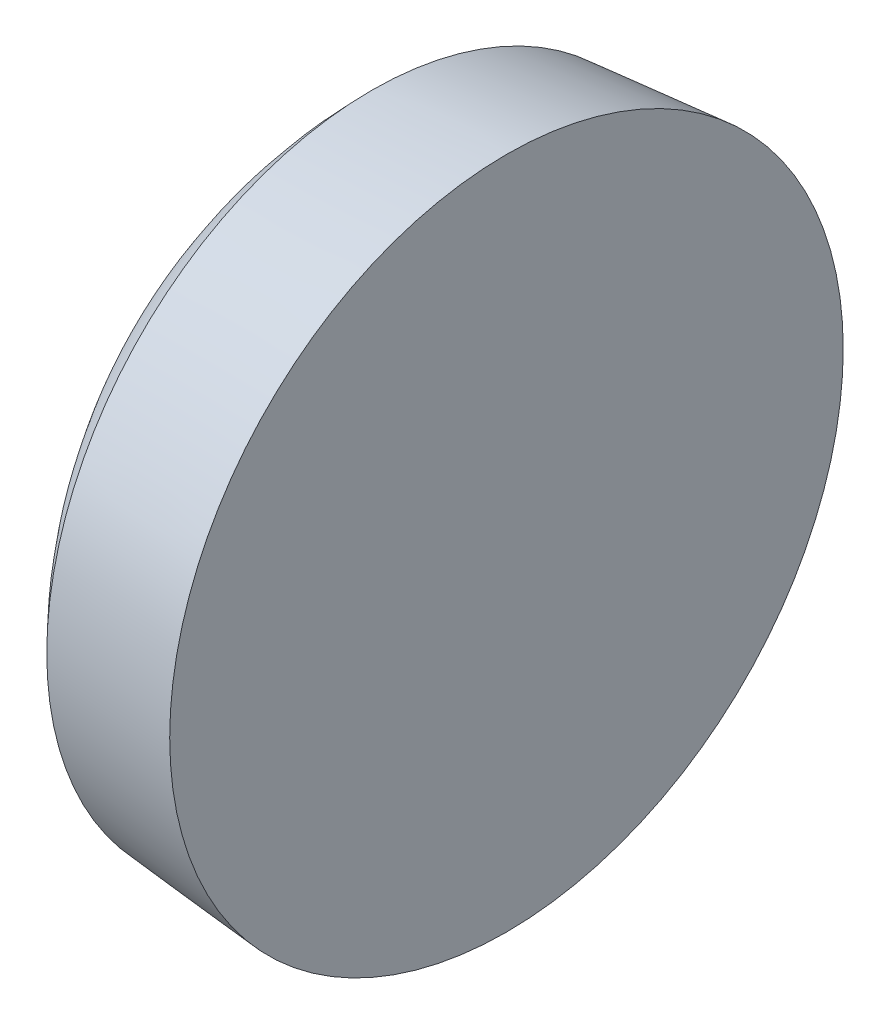
ISO-10303-21;
HEADER;
FILE_DESCRIPTION(('STEP AP214'),'2;1');
FILE_NAME('part.step','',(''),(''),'','','');
FILE_SCHEMA(('AUTOMOTIVE_DESIGN { 1 0 10303 214 1 1 1 1 }'));
ENDSEC;
DATA;
#1=APPLICATION_CONTEXT('core data for automotive mechanical design processes');
#2=APPLICATION_PROTOCOL_DEFINITION('international standard','automotive_design',2000,#1);
#3=PRODUCT_CONTEXT('',#1,'mechanical');
#4=PRODUCT('Part','Part','',(#3));
#5=PRODUCT_RELATED_PRODUCT_CATEGORY('part','',(#4));
#6=PRODUCT_DEFINITION_FORMATION('','',#4);
#7=PRODUCT_DEFINITION_CONTEXT('part definition',#1,'design');
#8=PRODUCT_DEFINITION('design','',#6,#7);
#9=PRODUCT_DEFINITION_SHAPE('','',#8);
#10=(LENGTH_UNIT() NAMED_UNIT(*) SI_UNIT(.MILLI.,.METRE.));
#11=(NAMED_UNIT(*) PLANE_ANGLE_UNIT() SI_UNIT($,.RADIAN.));
#12=(NAMED_UNIT(*) SI_UNIT($,.STERADIAN.) SOLID_ANGLE_UNIT());
#13=UNCERTAINTY_MEASURE_WITH_UNIT(LENGTH_MEASURE(1.E-05),#10,'distance_accuracy_value','');
#14=(GEOMETRIC_REPRESENTATION_CONTEXT(3) GLOBAL_UNCERTAINTY_ASSIGNED_CONTEXT((#13)) GLOBAL_UNIT_ASSIGNED_CONTEXT((#10,
#11,#12)) REPRESENTATION_CONTEXT('',''));
#15=CARTESIAN_POINT('',(0.,0.,0.));
#16=DIRECTION('',(0.,0.,1.));
#17=DIRECTION('',(1.,0.,0.));
#18=AXIS2_PLACEMENT_3D('',#15,#16,#17);
#19=CARTESIAN_POINT('',(71.8666666666667,-6.9,10.));
#20=DIRECTION('',(-1.,0.,0.));
#21=DIRECTION('',(0.,0.,1.));
#22=AXIS2_PLACEMENT_3D('',#19,#20,#21);
#23=PLANE('',#22);
#24=DIRECTION('',(0.,0.,-1.));
#25=VECTOR('',#24,1.);
#26=CARTESIAN_POINT('',(71.8666666666667,-5.95,10.));
#27=LINE('',#26,#25);
#28=CARTESIAN_POINT('',(71.8666666666667,-5.95,9.82));
#29=VERTEX_POINT('',#28);
#30=CARTESIAN_POINT('',(71.8666666666667,-5.95,10.18));
#31=VERTEX_POINT('',#30);
#32=EDGE_CURVE('E293',#29,#31,#27,.F.);
#33=ORIENTED_EDGE('',*,*,#32,.F.);
#34=DIRECTION('',(0.,1.,0.));
#35=VECTOR('',#34,1.);
#36=CARTESIAN_POINT('',(71.8666666666667,-6.9,9.82));
#37=LINE('',#36,#35);
#38=CARTESIAN_POINT('',(71.8666666666667,-6.72,9.82));
#39=VERTEX_POINT('',#38);
#40=EDGE_CURVE('E298',#39,#29,#37,.T.);
#41=ORIENTED_EDGE('',*,*,#40,.F.);
#42=DIRECTION('',(0.,0.,-1.));
#43=VECTOR('',#42,1.);
#44=CARTESIAN_POINT('',(71.8666666666667,-6.72,10.));
#45=LINE('',#44,#43);
#46=CARTESIAN_POINT('',(71.8666666666667,-6.72,9.05));
#47=VERTEX_POINT('',#46);
#48=EDGE_CURVE('E303',#47,#39,#45,.F.);
#49=ORIENTED_EDGE('',*,*,#48,.F.);
#50=DIRECTION('',(0.,1.,0.));
#51=VECTOR('',#50,1.);
#52=CARTESIAN_POINT('',(71.8666666666667,-6.9,9.05));
#53=LINE('',#52,#51);
#54=CARTESIAN_POINT('',(71.8666666666667,-7.08,9.05));
#55=VERTEX_POINT('',#54);
#56=EDGE_CURVE('E308',#55,#47,#53,.T.);
#57=ORIENTED_EDGE('',*,*,#56,.F.);
#58=DIRECTION('',(0.,0.,1.));
#59=VECTOR('',#58,1.);
#60=CARTESIAN_POINT('',(71.8666666666667,-7.08,10.));
#61=LINE('',#60,#59);
#62=CARTESIAN_POINT('',(71.8666666666667,-7.08,9.82));
#63=VERTEX_POINT('',#62);
#64=EDGE_CURVE('E313',#63,#55,#61,.F.);
#65=ORIENTED_EDGE('',*,*,#64,.F.);
#66=DIRECTION('',(0.,1.,0.));
#67=VECTOR('',#66,1.);
#68=CARTESIAN_POINT('',(71.8666666666667,-6.9,9.82));
#69=LINE('',#68,#67);
#70=CARTESIAN_POINT('',(71.8666666666667,-7.85,9.82));
#71=VERTEX_POINT('',#70);
#72=EDGE_CURVE('E318',#71,#63,#69,.T.);
#73=ORIENTED_EDGE('',*,*,#72,.F.);
#74=DIRECTION('',(0.,0.,-1.));
#75=VECTOR('',#74,1.);
#76=CARTESIAN_POINT('',(71.8666666666667,-7.85,10.));
#77=LINE('',#76,#75);
#78=CARTESIAN_POINT('',(71.8666666666667,-7.85,10.18));
#79=VERTEX_POINT('',#78);
#80=EDGE_CURVE('E267',#71,#79,#77,.F.);
#81=ORIENTED_EDGE('',*,*,#80,.T.);
#82=DIRECTION('',(0.,1.,0.));
#83=VECTOR('',#82,1.);
#84=CARTESIAN_POINT('',(71.8666666666667,-6.9,10.18));
#85=LINE('',#84,#83);
#86=CARTESIAN_POINT('',(71.8666666666667,-7.08,10.18));
#87=VERTEX_POINT('',#86);
#88=EDGE_CURVE('E264',#87,#79,#85,.F.);
#89=ORIENTED_EDGE('',*,*,#88,.F.);
#90=DIRECTION('',(0.,0.,1.));
#91=VECTOR('',#90,1.);
#92=CARTESIAN_POINT('',(71.8666666666667,-7.08,10.));
#93=LINE('',#92,#91);
#94=CARTESIAN_POINT('',(71.8666666666667,-7.08,10.95));
#95=VERTEX_POINT('',#94);
#96=EDGE_CURVE('E260',#95,#87,#93,.F.);
#97=ORIENTED_EDGE('',*,*,#96,.F.);
#98=DIRECTION('',(0.,1.,0.));
#99=VECTOR('',#98,1.);
#100=CARTESIAN_POINT('',(71.8666666666667,-6.9,10.95));
#101=LINE('',#100,#99);
#102=CARTESIAN_POINT('',(71.8666666666667,-6.72,10.95));
#103=VERTEX_POINT('',#102);
#104=EDGE_CURVE('E231',#95,#103,#101,.T.);
#105=ORIENTED_EDGE('',*,*,#104,.T.);
#106=DIRECTION('',(0.,0.,-1.));
#107=VECTOR('',#106,1.);
#108=CARTESIAN_POINT('',(71.8666666666667,-6.72,10.));
#109=LINE('',#108,#107);
#110=CARTESIAN_POINT('',(71.8666666666667,-6.72,10.18));
#111=VERTEX_POINT('',#110);
#112=EDGE_CURVE('E278',#111,#103,#109,.F.);
#113=ORIENTED_EDGE('',*,*,#112,.F.);
#114=DIRECTION('',(0.,1.,0.));
#115=VECTOR('',#114,1.);
#116=CARTESIAN_POINT('',(71.8666666666667,-6.9,10.18));
#117=LINE('',#116,#115);
#118=EDGE_CURVE('E288',#31,#111,#117,.F.);
#119=ORIENTED_EDGE('',*,*,#118,.F.);
#120=EDGE_LOOP('',(#33,#41,#49,#57,#65,#73,#81,#89,#97,#105,#113,#119));
#121=FACE_BOUND('',#120,.T.);
#122=ADVANCED_FACE('F17',(#121),#23,.T.);
#123=CARTESIAN_POINT('',(71.2666666666667,-7.08,10.));
#124=DIRECTION('',(0.,1.,0.));
#125=DIRECTION('',(0.,0.,1.));
#126=AXIS2_PLACEMENT_3D('',#123,#124,#125);
#127=PLANE('',#126);
#128=DIRECTION('',(1.,0.,0.));
#129=VECTOR('',#128,1.);
#130=CARTESIAN_POINT('',(71.2666666666667,-7.08,10.95));
#131=LINE('',#130,#129);
#132=CARTESIAN_POINT('',(70.8437621434756,-7.08,10.95));
#133=VERTEX_POINT('',#132);
#134=EDGE_CURVE('E89',#133,#95,#131,.T.);
#135=ORIENTED_EDGE('',*,*,#134,.T.);
#136=ORIENTED_EDGE('',*,*,#96,.T.);
#137=DIRECTION('',(-1.,0.,0.));
#138=VECTOR('',#137,1.);
#139=CARTESIAN_POINT('',(71.2666666666667,-7.08,10.18));
#140=LINE('',#139,#138);
#141=CARTESIAN_POINT('',(70.6785690968727,-7.08,10.18));
#142=VERTEX_POINT('',#141);
#143=EDGE_CURVE('E224',#142,#87,#140,.F.);
#144=ORIENTED_EDGE('',*,*,#143,.F.);
#145=CARTESIAN_POINT('',(70.8437621434756,-7.08,10.95));
#146=CARTESIAN_POINT('',(70.8322171292822,-7.08,10.9189995540506));
#147=CARTESIAN_POINT('',(70.8212377468981,-7.08,10.8877884938067));
#148=CARTESIAN_POINT('',(70.8004645483596,-7.08,10.8251104536469));
#149=CARTESIAN_POINT('',(70.7906662413493,-7.08,10.7936449620741));
#150=CARTESIAN_POINT('',(70.7722427007091,-7.08,10.7304618501356));
#151=CARTESIAN_POINT('',(70.7636144610796,-7.08,10.6987451062672));
#152=CARTESIAN_POINT('',(70.747522711913,-7.08,10.6350619663155));
#153=CARTESIAN_POINT('',(70.7400576830911,-7.08,10.6030959541242));
#154=CARTESIAN_POINT('',(70.7262885047045,-7.08,10.5389148788568));
#155=CARTESIAN_POINT('',(70.7199843551398,-7.08,10.5066998157808));
#156=CARTESIAN_POINT('',(70.7085376077745,-7.08,10.4420201537524));
#157=CARTESIAN_POINT('',(70.7033965530294,-7.08,10.4095552817086));
#158=CARTESIAN_POINT('',(70.6942815043555,-7.08,10.3443751591893));
#159=CARTESIAN_POINT('',(70.6903106114274,-7.08,10.3116594750372));
#160=CARTESIAN_POINT('',(70.6835456245179,-7.08,10.2459761632456));
#161=CARTESIAN_POINT('',(70.6807562366993,-7.08,10.2130080508538));
#162=CARTESIAN_POINT('',(70.6785690968726,-7.08,10.18));
#163=B_SPLINE_CURVE_WITH_KNOTS('',3,(#145,#146,#147,#148,#149,#150,#151,#152,#153,#154,#155,
#156,#157,#158,#159,#160,#161,#162),.UNSPECIFIED.,.F.,.F.,(4,2,2,2,2,2,2,2,4),(0.,
0.0992357442434171,0.198081387639275,0.296668072480497,0.395124892694099,0.4935817129077,
0.592168397748929,0.691014041144783,0.790249785388203),.UNSPECIFIED.);
#164=EDGE_CURVE('E20',#133,#142,#163,.T.);
#165=ORIENTED_EDGE('',*,*,#164,.F.);
#166=EDGE_LOOP('',(#135,#136,#144,#165));
#167=FACE_BOUND('',#166,.T.);
#168=ADVANCED_FACE('F221',(#167),#127,.T.);
#169=CARTESIAN_POINT('',(71.2666666666667,-6.9,10.18));
#170=DIRECTION('',(0.,0.,-1.));
#171=DIRECTION('',(-1.,0.,0.));
#172=AXIS2_PLACEMENT_3D('',#169,#170,#171);
#173=PLANE('',#172);
#174=ORIENTED_EDGE('',*,*,#88,.T.);
#175=DIRECTION('',(1.,0.,0.));
#176=VECTOR('',#175,1.);
#177=CARTESIAN_POINT('',(71.2666666666667,-7.85,10.18));
#178=LINE('',#177,#176);
#179=CARTESIAN_POINT('',(70.8437621434756,-7.85,10.18));
#180=VERTEX_POINT('',#179);
#181=EDGE_CURVE('E324',#79,#180,#178,.F.);
#182=ORIENTED_EDGE('',*,*,#181,.T.);
#183=CARTESIAN_POINT('',(70.6785690968726,-7.08000000000001,10.18));
#184=CARTESIAN_POINT('',(70.6842232755615,-7.16559008255583,10.18));
#185=CARTESIAN_POINT('',(70.6939547629615,-7.2509034773777,10.18));
#186=CARTESIAN_POINT('',(70.721321880478,-7.41965906159769,10.18));
#187=CARTESIAN_POINT('',(70.7389034345171,-7.50311001948196,10.18));
#188=CARTESIAN_POINT('',(70.7836325640795,-7.67504249159046,10.18));
#189=CARTESIAN_POINT('',(70.8114686271752,-7.76334531100346,10.18));
#190=CARTESIAN_POINT('',(70.8437621434756,-7.85000000000001,10.18));
#191=B_SPLINE_CURVE_WITH_KNOTS('',3,(#183,#184,#185,#186,#187,#188,#189,#190),.UNSPECIFIED.,.F.,
.F.,(4,2,2,4),(0.,0.257221658829344,0.512698117737358,0.789983486231617),.UNSPECIFIED.);
#192=EDGE_CURVE('E213',#142,#180,#191,.T.);
#193=ORIENTED_EDGE('',*,*,#192,.F.);
#194=ORIENTED_EDGE('',*,*,#143,.T.);
#195=EDGE_LOOP('',(#174,#182,#193,#194));
#196=FACE_BOUND('',#195,.T.);
#197=ADVANCED_FACE('F204',(#196),#173,.T.);
#198=CARTESIAN_POINT('',(71.2666666666667,-7.85,10.));
#199=DIRECTION('',(0.,-1.,0.));
#200=DIRECTION('',(0.,0.,-1.));
#201=AXIS2_PLACEMENT_3D('',#198,#199,#200);
#202=PLANE('',#201);
#203=ORIENTED_EDGE('',*,*,#181,.F.);
#204=ORIENTED_EDGE('',*,*,#80,.F.);
#205=DIRECTION('',(1.,0.,0.));
#206=VECTOR('',#205,1.);
#207=CARTESIAN_POINT('',(71.2666666666667,-7.85,9.82));
#208=LINE('',#207,#206);
#209=CARTESIAN_POINT('',(70.8437621434756,-7.85,9.82));
#210=VERTEX_POINT('',#209);
#211=EDGE_CURVE('E320',#210,#71,#208,.T.);
#212=ORIENTED_EDGE('',*,*,#211,.F.);
#213=CARTESIAN_POINT('',(70.8437621434756,-7.85,10.18));
#214=CARTESIAN_POINT('',(70.8395337477772,-7.85000000000002,10.12));
#215=CARTESIAN_POINT('',(70.8374195499281,-7.85000000000002,10.06));
#216=CARTESIAN_POINT('',(70.8374195499281,-7.84999999999998,9.93999999999996));
#217=CARTESIAN_POINT('',(70.8395337477772,-7.84999999999994,9.87999999999995));
#218=CARTESIAN_POINT('',(70.8437621434755,-7.84999999999989,9.81999999999994));
#219=B_SPLINE_CURVE_WITH_KNOTS('',3,(#213,#214,#215,#216,#217,#218),.UNSPECIFIED.,.F.,.F.,(4,2,
4),(0.,0.18011171114872,0.360223422297441),.UNSPECIFIED.);
#220=EDGE_CURVE('E207',#180,#210,#219,.T.);
#221=ORIENTED_EDGE('',*,*,#220,.F.);
#222=EDGE_LOOP('',(#203,#204,#212,#221));
#223=FACE_BOUND('',#222,.T.);
#224=ADVANCED_FACE('F199',(#223),#202,.F.);
#225=CARTESIAN_POINT('',(71.2666666666667,-6.9,9.82));
#226=DIRECTION('',(0.,0.,1.));
#227=DIRECTION('',(1.,0.,0.));
#228=AXIS2_PLACEMENT_3D('',#225,#226,#227);
#229=PLANE('',#228);
#230=ORIENTED_EDGE('',*,*,#72,.T.);
#231=DIRECTION('',(1.,0.,0.));
#232=VECTOR('',#231,1.);
#233=CARTESIAN_POINT('',(71.2666666666667,-7.08,9.82));
#234=LINE('',#233,#232);
#235=CARTESIAN_POINT('',(70.6785690968727,-7.08,9.82));
#236=VERTEX_POINT('',#235);
#237=EDGE_CURVE('E315',#236,#63,#234,.T.);
#238=ORIENTED_EDGE('',*,*,#237,.F.);
#239=CARTESIAN_POINT('',(70.8437621434756,-7.85000000000001,9.82));
#240=CARTESIAN_POINT('',(70.8322171292822,-7.81899955405059,9.82));
#241=CARTESIAN_POINT('',(70.8212377468981,-7.78778849380673,9.82));
#242=CARTESIAN_POINT('',(70.8004645483596,-7.72511045364685,9.82));
#243=CARTESIAN_POINT('',(70.7906662413493,-7.69364496207406,9.82));
#244=CARTESIAN_POINT('',(70.7722427007091,-7.6304618501356,9.82));
#245=CARTESIAN_POINT('',(70.7636144610796,-7.59874510626724,9.82));
#246=CARTESIAN_POINT('',(70.747522711913,-7.53506196631551,9.82));
#247=CARTESIAN_POINT('',(70.7400576830911,-7.50309595412419,9.82));
#248=CARTESIAN_POINT('',(70.7262885047045,-7.43891487885684,9.82));
#249=CARTESIAN_POINT('',(70.7199843551398,-7.4066998157808,9.82));
#250=CARTESIAN_POINT('',(70.7085376077745,-7.3420201537524,9.82));
#251=CARTESIAN_POINT('',(70.7033965530294,-7.30955528170857,9.82));
#252=CARTESIAN_POINT('',(70.6942815043555,-7.24437515918932,9.82));
#253=CARTESIAN_POINT('',(70.6903106114274,-7.21165947503724,9.82));
#254=CARTESIAN_POINT('',(70.6835456245179,-7.14597616324561,9.82));
#255=CARTESIAN_POINT('',(70.6807562366993,-7.11300805085379,9.82));
#256=CARTESIAN_POINT('',(70.6785690968726,-7.08000000000001,9.82));
#257=B_SPLINE_CURVE_WITH_KNOTS('',3,(#239,#240,#241,#242,#243,#244,#245,#246,#247,#248,#249,
#250,#251,#252,#253,#254,#255,#256),.UNSPECIFIED.,.F.,.F.,(4,2,2,2,2,2,2,2,4),(0.,
0.0992357442434187,0.198081387639275,0.296668072480498,0.395124892694101,0.493581712907701,
0.592168397748928,0.691014041144783,0.790249785388204),.UNSPECIFIED.);
#258=EDGE_CURVE('E184',#210,#236,#257,.T.);
#259=ORIENTED_EDGE('',*,*,#258,.F.);
#260=ORIENTED_EDGE('',*,*,#211,.T.);
#261=EDGE_LOOP('',(#230,#238,#259,#260));
#262=FACE_BOUND('',#261,.T.);
#263=ADVANCED_FACE('F194',(#262),#229,.T.);
#264=CARTESIAN_POINT('',(71.2666666666667,-7.08,10.));
#265=DIRECTION('',(0.,1.,0.));
#266=DIRECTION('',(0.,0.,1.));
#267=AXIS2_PLACEMENT_3D('',#264,#265,#266);
#268=PLANE('',#267);
#269=DIRECTION('',(1.,0.,0.));
#270=VECTOR('',#269,1.);
#271=CARTESIAN_POINT('',(71.2666666666667,-7.08,9.05));
#272=LINE('',#271,#270);
#273=CARTESIAN_POINT('',(70.8437621434756,-7.08,9.05));
#274=VERTEX_POINT('',#273);
#275=EDGE_CURVE('E310',#274,#55,#272,.T.);
#276=ORIENTED_EDGE('',*,*,#275,.F.);
#277=CARTESIAN_POINT('',(70.6785690968726,-7.08,9.81999999999999));
#278=CARTESIAN_POINT('',(70.6842232755615,-7.08,9.73440991744418));
#279=CARTESIAN_POINT('',(70.6939547629615,-7.08,9.6490965226223));
#280=CARTESIAN_POINT('',(70.721321880478,-7.08,9.48034093840231));
#281=CARTESIAN_POINT('',(70.7389034345171,-7.08,9.39688998051804));
#282=CARTESIAN_POINT('',(70.7836325640795,-7.08,9.22495750840954));
#283=CARTESIAN_POINT('',(70.8114686271752,-7.08,9.13665468899654));
#284=CARTESIAN_POINT('',(70.8437621434756,-7.08,9.04999999999999));
#285=B_SPLINE_CURVE_WITH_KNOTS('',3,(#277,#278,#279,#280,#281,#282,#283,#284),.UNSPECIFIED.,.F.,
.F.,(4,2,2,4),(0.,0.257221658829345,0.512698117737359,0.789983486231617),.UNSPECIFIED.);
#286=EDGE_CURVE('E176',#236,#274,#285,.T.);
#287=ORIENTED_EDGE('',*,*,#286,.F.);
#288=ORIENTED_EDGE('',*,*,#237,.T.);
#289=ORIENTED_EDGE('',*,*,#64,.T.);
#290=EDGE_LOOP('',(#276,#287,#288,#289));
#291=FACE_BOUND('',#290,.T.);
#292=ADVANCED_FACE('F191',(#291),#268,.T.);
#293=CARTESIAN_POINT('',(71.2666666666667,-6.9,9.05));
#294=DIRECTION('',(0.,0.,1.));
#295=DIRECTION('',(1.,0.,0.));
#296=AXIS2_PLACEMENT_3D('',#293,#294,#295);
#297=PLANE('',#296);
#298=DIRECTION('',(1.,0.,0.));
#299=VECTOR('',#298,1.);
#300=CARTESIAN_POINT('',(71.2666666666667,-6.72,9.05));
#301=LINE('',#300,#299);
#302=CARTESIAN_POINT('',(70.8437621434756,-6.72,9.05));
#303=VERTEX_POINT('',#302);
#304=EDGE_CURVE('E305',#303,#47,#301,.T.);
#305=ORIENTED_EDGE('',*,*,#304,.F.);
#306=CARTESIAN_POINT('',(70.8437621434756,-6.72,9.05));
#307=CARTESIAN_POINT('',(70.8374195499281,-6.80988825418617,9.05));
#308=CARTESIAN_POINT('',(70.8374195499281,-6.9,9.05));
#309=B_SPLINE_CURVE_WITH_KNOTS('',2,(#306,#307,#308),.UNSPECIFIED.,.F.,.F.,(3,3),(0.,1.),.UNSPECIFIED.);
#310=CARTESIAN_POINT('',(70.8374195499281,-6.9,9.05));
#311=VERTEX_POINT('',#310);
#312=EDGE_CURVE('E175',#311,#303,#309,.F.);
#313=ORIENTED_EDGE('',*,*,#312,.F.);
#314=CARTESIAN_POINT('',(70.8374195499281,-6.9,9.05));
#315=CARTESIAN_POINT('',(70.8374195499281,-6.99011174581383,9.05));
#316=CARTESIAN_POINT('',(70.8437621434756,-7.08,9.05));
#317=B_SPLINE_CURVE_WITH_KNOTS('',2,(#314,#315,#316),.UNSPECIFIED.,.F.,.F.,(3,3),(0.,1.),.UNSPECIFIED.);
#318=EDGE_CURVE('E183',#274,#311,#317,.F.);
#319=ORIENTED_EDGE('',*,*,#318,.F.);
#320=ORIENTED_EDGE('',*,*,#275,.T.);
#321=ORIENTED_EDGE('',*,*,#56,.T.);
#322=EDGE_LOOP('',(#305,#313,#319,#320,#321));
#323=FACE_BOUND('',#322,.T.);
#324=ADVANCED_FACE('F164',(#323),#297,.T.);
#325=CARTESIAN_POINT('',(71.2666666666667,-6.72,10.));
#326=DIRECTION('',(0.,-1.,0.));
#327=DIRECTION('',(0.,0.,-1.));
#328=AXIS2_PLACEMENT_3D('',#325,#326,#327);
#329=PLANE('',#328);
#330=ORIENTED_EDGE('',*,*,#304,.T.);
#331=ORIENTED_EDGE('',*,*,#48,.T.);
#332=DIRECTION('',(1.,0.,0.));
#333=VECTOR('',#332,1.);
#334=CARTESIAN_POINT('',(71.2666666666667,-6.72,9.82));
#335=LINE('',#334,#333);
#336=CARTESIAN_POINT('',(70.6785690968727,-6.72,9.82));
#337=VERTEX_POINT('',#336);
#338=EDGE_CURVE('E300',#337,#39,#335,.T.);
#339=ORIENTED_EDGE('',*,*,#338,.F.);
#340=CARTESIAN_POINT('',(70.8437621434756,-6.72,9.04999999999999));
#341=CARTESIAN_POINT('',(70.8322171292822,-6.72,9.08100044594941));
#342=CARTESIAN_POINT('',(70.8212377468981,-6.72,9.11221150619327));
#343=CARTESIAN_POINT('',(70.8004645483596,-6.72,9.17488954635315));
#344=CARTESIAN_POINT('',(70.7906662413493,-6.72,9.20635503792594));
#345=CARTESIAN_POINT('',(70.7722427007091,-6.72,9.2695381498644));
#346=CARTESIAN_POINT('',(70.7636144610796,-6.72,9.30125489373276));
#347=CARTESIAN_POINT('',(70.747522711913,-6.72,9.36493803368449));
#348=CARTESIAN_POINT('',(70.7400576830911,-6.72,9.39690404587581));
#349=CARTESIAN_POINT('',(70.7262885047045,-6.72,9.46108512114316));
#350=CARTESIAN_POINT('',(70.7199843551398,-6.72,9.4933001842192));
#351=CARTESIAN_POINT('',(70.7085376077745,-6.72,9.55797984624761));
#352=CARTESIAN_POINT('',(70.7033965530294,-6.72,9.59044471829143));
#353=CARTESIAN_POINT('',(70.6942815043555,-6.72,9.65562484081068));
#354=CARTESIAN_POINT('',(70.6903106114274,-6.72,9.68834052496277));
#355=CARTESIAN_POINT('',(70.6835456245179,-6.72,9.75402383675439));
#356=CARTESIAN_POINT('',(70.6807562366993,-6.72,9.78699194914621));
#357=CARTESIAN_POINT('',(70.6785690968726,-6.72,9.81999999999999));
#358=B_SPLINE_CURVE_WITH_KNOTS('',3,(#340,#341,#342,#343,#344,#345,#346,#347,#348,#349,#350,
#351,#352,#353,#354,#355,#356,#357),.UNSPECIFIED.,.F.,.F.,(4,2,2,2,2,2,2,2,4),(0.,
0.0992357442434187,0.198081387639275,0.296668072480497,0.395124892694101,0.493581712907701,
0.592168397748929,0.691014041144783,0.790249785388203),.UNSPECIFIED.);
#359=EDGE_CURVE('E168',#303,#337,#358,.T.);
#360=ORIENTED_EDGE('',*,*,#359,.F.);
#361=EDGE_LOOP('',(#330,#331,#339,#360));
#362=FACE_BOUND('',#361,.T.);
#363=ADVANCED_FACE('F159',(#362),#329,.T.);
#364=CARTESIAN_POINT('',(71.2666666666667,-6.9,9.82));
#365=DIRECTION('',(0.,0.,1.));
#366=DIRECTION('',(1.,0.,0.));
#367=AXIS2_PLACEMENT_3D('',#364,#365,#366);
#368=PLANE('',#367);
#369=ORIENTED_EDGE('',*,*,#40,.T.);
#370=DIRECTION('',(1.,0.,0.));
#371=VECTOR('',#370,1.);
#372=CARTESIAN_POINT('',(71.2666666666667,-5.95,9.82));
#373=LINE('',#372,#371);
#374=CARTESIAN_POINT('',(70.8437621434756,-5.95,9.82));
#375=VERTEX_POINT('',#374);
#376=EDGE_CURVE('E295',#375,#29,#373,.T.);
#377=ORIENTED_EDGE('',*,*,#376,.F.);
#378=CARTESIAN_POINT('',(70.6785690968726,-6.72,9.82));
#379=CARTESIAN_POINT('',(70.6842232755615,-6.63440991744418,9.82));
#380=CARTESIAN_POINT('',(70.6939547629615,-6.54909652262231,9.82));
#381=CARTESIAN_POINT('',(70.721321880478,-6.38034093840231,9.82));
#382=CARTESIAN_POINT('',(70.7389034345171,-6.29688998051804,9.82));
#383=CARTESIAN_POINT('',(70.7836325640795,-6.12495750840954,9.82));
#384=CARTESIAN_POINT('',(70.8114686271752,-6.03665468899654,9.82));
#385=CARTESIAN_POINT('',(70.8437621434756,-5.94999999999999,9.82));
#386=B_SPLINE_CURVE_WITH_KNOTS('',3,(#378,#379,#380,#381,#382,#383,#384,#385),.UNSPECIFIED.,.F.,
.F.,(4,2,2,4),(0.,0.257221658829344,0.512698117737359,0.789983486231619),.UNSPECIFIED.);
#387=EDGE_CURVE('E144',#337,#375,#386,.T.);
#388=ORIENTED_EDGE('',*,*,#387,.F.);
#389=ORIENTED_EDGE('',*,*,#338,.T.);
#390=EDGE_LOOP('',(#369,#377,#388,#389));
#391=FACE_BOUND('',#390,.T.);
#392=ADVANCED_FACE('F154',(#391),#368,.T.);
#393=CARTESIAN_POINT('',(71.2666666666667,-5.95,10.));
#394=DIRECTION('',(0.,-1.,0.));
#395=DIRECTION('',(0.,0.,-1.));
#396=AXIS2_PLACEMENT_3D('',#393,#394,#395);
#397=PLANE('',#396);
#398=ORIENTED_EDGE('',*,*,#32,.T.);
#399=DIRECTION('',(-1.,0.,0.));
#400=VECTOR('',#399,1.);
#401=CARTESIAN_POINT('',(71.2666666666667,-5.95,10.18));
#402=LINE('',#401,#400);
#403=CARTESIAN_POINT('',(70.8437621434756,-5.94999999999999,10.18));
#404=VERTEX_POINT('',#403);
#405=EDGE_CURVE('E290',#404,#31,#402,.F.);
#406=ORIENTED_EDGE('',*,*,#405,.F.);
#407=CARTESIAN_POINT('',(70.8437621434756,-5.95,9.82));
#408=CARTESIAN_POINT('',(70.8395337477772,-5.94999999999999,9.88000000000001));
#409=CARTESIAN_POINT('',(70.8374195499281,-5.94999999999999,9.94000000000002));
#410=CARTESIAN_POINT('',(70.8374195499281,-5.95000000000001,10.06));
#411=CARTESIAN_POINT('',(70.8395337477772,-5.95000000000003,10.12));
#412=CARTESIAN_POINT('',(70.8437621434755,-5.95000000000006,10.1800000000001));
#413=B_SPLINE_CURVE_WITH_KNOTS('',3,(#407,#408,#409,#410,#411,#412),.UNSPECIFIED.,.F.,.F.,(4,2,
4),(0.,0.18011171114872,0.360223422297441),.UNSPECIFIED.);
#414=EDGE_CURVE('E137',#375,#404,#413,.T.);
#415=ORIENTED_EDGE('',*,*,#414,.F.);
#416=ORIENTED_EDGE('',*,*,#376,.T.);
#417=EDGE_LOOP('',(#398,#406,#415,#416));
#418=FACE_BOUND('',#417,.T.);
#419=ADVANCED_FACE('F151',(#418),#397,.T.);
#420=CARTESIAN_POINT('',(71.2666666666667,-6.9,10.18));
#421=DIRECTION('',(0.,0.,-1.));
#422=DIRECTION('',(-1.,0.,0.));
#423=AXIS2_PLACEMENT_3D('',#420,#421,#422);
#424=PLANE('',#423);
#425=ORIENTED_EDGE('',*,*,#118,.T.);
#426=DIRECTION('',(1.,0.,0.));
#427=VECTOR('',#426,1.);
#428=CARTESIAN_POINT('',(71.2666666666667,-6.72,10.18));
#429=LINE('',#428,#427);
#430=CARTESIAN_POINT('',(70.6785690968727,-6.72,10.18));
#431=VERTEX_POINT('',#430);
#432=EDGE_CURVE('E280',#431,#111,#429,.T.);
#433=ORIENTED_EDGE('',*,*,#432,.F.);
#434=CARTESIAN_POINT('',(70.8437621434756,-5.94999999999999,10.18));
#435=CARTESIAN_POINT('',(70.8322171292822,-5.98100044594941,10.18));
#436=CARTESIAN_POINT('',(70.8212377468981,-6.01221150619326,10.18));
#437=CARTESIAN_POINT('',(70.8004645483596,-6.07488954635315,10.18));
#438=CARTESIAN_POINT('',(70.7906662413493,-6.10635503792594,10.18));
#439=CARTESIAN_POINT('',(70.7722427007091,-6.1695381498644,10.18));
#440=CARTESIAN_POINT('',(70.7636144610796,-6.20125489373276,10.18));
#441=CARTESIAN_POINT('',(70.747522711913,-6.26493803368449,10.18));
#442=CARTESIAN_POINT('',(70.7400576830911,-6.29690404587581,10.18));
#443=CARTESIAN_POINT('',(70.7262885047045,-6.36108512114316,10.18));
#444=CARTESIAN_POINT('',(70.7199843551398,-6.3933001842192,10.18));
#445=CARTESIAN_POINT('',(70.7085376077745,-6.4579798462476,10.18));
#446=CARTESIAN_POINT('',(70.7033965530294,-6.49044471829143,10.18));
#447=CARTESIAN_POINT('',(70.6942815043555,-6.55562484081068,10.18));
#448=CARTESIAN_POINT('',(70.6903106114274,-6.58834052496277,10.18));
#449=CARTESIAN_POINT('',(70.6835456245179,-6.65402383675439,10.18));
#450=CARTESIAN_POINT('',(70.6807562366993,-6.68699194914621,10.18));
#451=CARTESIAN_POINT('',(70.6785690968726,-6.72,10.18));
#452=B_SPLINE_CURVE_WITH_KNOTS('',3,(#434,#435,#436,#437,#438,#439,#440,#441,#442,#443,#444,
#445,#446,#447,#448,#449,#450,#451),.UNSPECIFIED.,.F.,.F.,(4,2,2,2,2,2,2,2,4),(0.,
0.0992357442434179,0.198081387639275,0.296668072480498,0.395124892694101,0.4935817129077,
0.592168397748929,0.691014041144784,0.790249785388204),.UNSPECIFIED.);
#453=EDGE_CURVE('E100',#404,#431,#452,.T.);
#454=ORIENTED_EDGE('',*,*,#453,.F.);
#455=ORIENTED_EDGE('',*,*,#405,.T.);
#456=EDGE_LOOP('',(#425,#433,#454,#455));
#457=FACE_BOUND('',#456,.T.);
#458=ADVANCED_FACE('F123',(#457),#424,.T.);
#459=CARTESIAN_POINT('',(71.2666666666667,-6.72,10.));
#460=DIRECTION('',(0.,-1.,0.));
#461=DIRECTION('',(0.,0.,-1.));
#462=AXIS2_PLACEMENT_3D('',#459,#460,#461);
#463=PLANE('',#462);
#464=DIRECTION('',(1.,0.,0.));
#465=VECTOR('',#464,1.);
#466=CARTESIAN_POINT('',(71.2666666666667,-6.72,10.95));
#467=LINE('',#466,#465);
#468=CARTESIAN_POINT('',(70.8437621434756,-6.72,10.95));
#469=VERTEX_POINT('',#468);
#470=EDGE_CURVE('E40',#103,#469,#467,.F.);
#471=ORIENTED_EDGE('',*,*,#470,.T.);
#472=CARTESIAN_POINT('',(70.6785690968726,-6.72,10.18));
#473=CARTESIAN_POINT('',(70.6842232755615,-6.72,10.2655900825558));
#474=CARTESIAN_POINT('',(70.6939547629615,-6.72,10.3509034773777));
#475=CARTESIAN_POINT('',(70.721321880478,-6.72,10.5196590615977));
#476=CARTESIAN_POINT('',(70.7389034345171,-6.72,10.603110019482));
#477=CARTESIAN_POINT('',(70.7836325640795,-6.72,10.7750424915905));
#478=CARTESIAN_POINT('',(70.8114686271752,-6.72,10.8633453110035));
#479=CARTESIAN_POINT('',(70.8437621434756,-6.72,10.95));
#480=B_SPLINE_CURVE_WITH_KNOTS('',3,(#472,#473,#474,#475,#476,#477,#478,#479),.UNSPECIFIED.,.F.,
.F.,(4,2,2,4),(0.,0.257221658829346,0.512698117737361,0.789983486231617),.UNSPECIFIED.);
#481=EDGE_CURVE('E96',#431,#469,#480,.T.);
#482=ORIENTED_EDGE('',*,*,#481,.F.);
#483=ORIENTED_EDGE('',*,*,#432,.T.);
#484=ORIENTED_EDGE('',*,*,#112,.T.);
#485=EDGE_LOOP('',(#471,#482,#483,#484));
#486=FACE_BOUND('',#485,.T.);
#487=ADVANCED_FACE('F115',(#486),#463,.T.);
#488=CARTESIAN_POINT('',(71.2666666666667,-6.9,10.95));
#489=DIRECTION('',(0.,0.,1.));
#490=DIRECTION('',(1.,0.,0.));
#491=AXIS2_PLACEMENT_3D('',#488,#489,#490);
#492=PLANE('',#491);
#493=ORIENTED_EDGE('',*,*,#470,.F.);
#494=ORIENTED_EDGE('',*,*,#104,.F.);
#495=ORIENTED_EDGE('',*,*,#134,.F.);
#496=CARTESIAN_POINT('',(70.8374195499281,-6.9,10.95));
#497=CARTESIAN_POINT('',(70.8374195499281,-6.99011174581384,10.95));
#498=CARTESIAN_POINT('',(70.8437621434756,-7.08,10.95));
#499=B_SPLINE_CURVE_WITH_KNOTS('',2,(#496,#497,#498),.UNSPECIFIED.,.F.,.F.,(3,3),(0.,1.),.UNSPECIFIED.);
#500=CARTESIAN_POINT('',(70.8374195499281,-6.9,10.95));
#501=VERTEX_POINT('',#500);
#502=EDGE_CURVE('E82',#501,#133,#499,.T.);
#503=ORIENTED_EDGE('',*,*,#502,.F.);
#504=CARTESIAN_POINT('',(70.8437621434756,-6.72,10.95));
#505=CARTESIAN_POINT('',(70.8374195499281,-6.80988825418617,10.95));
#506=CARTESIAN_POINT('',(70.8374195499281,-6.9,10.95));
#507=B_SPLINE_CURVE_WITH_KNOTS('',2,(#504,#505,#506),.UNSPECIFIED.,.F.,.F.,(3,3),(0.,1.),.UNSPECIFIED.);
#508=EDGE_CURVE('E85',#469,#501,#507,.T.);
#509=ORIENTED_EDGE('',*,*,#508,.F.);
#510=EDGE_LOOP('',(#493,#494,#495,#503,#509));
#511=FACE_BOUND('',#510,.T.);
#512=ADVANCED_FACE('F84',(#511),#492,.F.);
#513=CARTESIAN_POINT('',(73.394751046113,-6.9,10.));
#514=DIRECTION('',(1.,0.,0.));
#515=DIRECTION('',(0.,1.,0.));
#516=AXIS2_PLACEMENT_3D('',#513,#514,#515);
#517=SPHERICAL_SURFACE('',#516,2.72808437944638);
#518=CARTESIAN_POINT('',(71.4666666666517,-6.9,10.));
#519=DIRECTION('',(1.,0.,0.));
#520=DIRECTION('',(0.,0.,1.));
#521=AXIS2_PLACEMENT_3D('',#518,#519,#520);
#522=CIRCLE('',#521,1.93000906917518);
#523=CARTESIAN_POINT('',(71.4666666666517,-6.89999999999993,11.9300090691752));
#524=VERTEX_POINT('',#523);
#525=EDGE_CURVE('E31',#524,#524,#522,.T.);
#526=ORIENTED_EDGE('',*,*,#525,.F.);
#527=EDGE_LOOP('',(#526));
#528=FACE_BOUND('',#527,.T.);
#529=ORIENTED_EDGE('',*,*,#481,.T.);
#530=ORIENTED_EDGE('',*,*,#508,.T.);
#531=ORIENTED_EDGE('',*,*,#502,.T.);
#532=ORIENTED_EDGE('',*,*,#164,.T.);
#533=ORIENTED_EDGE('',*,*,#192,.T.);
#534=ORIENTED_EDGE('',*,*,#220,.T.);
#535=ORIENTED_EDGE('',*,*,#258,.T.);
#536=ORIENTED_EDGE('',*,*,#286,.T.);
#537=ORIENTED_EDGE('',*,*,#318,.T.);
#538=ORIENTED_EDGE('',*,*,#312,.T.);
#539=ORIENTED_EDGE('',*,*,#359,.T.);
#540=ORIENTED_EDGE('',*,*,#387,.T.);
#541=ORIENTED_EDGE('',*,*,#414,.T.);
#542=ORIENTED_EDGE('',*,*,#453,.T.);
#543=EDGE_LOOP('',(#529,#530,#531,#532,#533,#534,#535,#536,#537,#538,#539,#540,#541,#542));
#544=FACE_BOUND('',#543,.T.);
#545=ADVANCED_FACE('F94',(#528,#544),#517,.T.);
#546=CARTESIAN_POINT('',(72.2666666666782,-6.9,10.));
#547=DIRECTION('',(1.,0.,0.));
#548=DIRECTION('',(0.,0.,-1.));
#549=AXIS2_PLACEMENT_3D('',#546,#547,#548);
#550=CONICAL_SURFACE('',#549,2.00000000000045,0.0872664626024547);
#551=CARTESIAN_POINT('',(72.2666666666782,-6.9,10.));
#552=DIRECTION('',(1.,0.,0.));
#553=DIRECTION('',(0.,0.,-1.));
#554=AXIS2_PLACEMENT_3D('',#551,#552,#553);
#555=CIRCLE('',#554,2.00000000000045);
#556=CARTESIAN_POINT('',(72.2666666666782,-6.9,7.99999999999955));
#557=VERTEX_POINT('',#556);
#558=EDGE_CURVE('E11',#557,#557,#555,.T.);
#559=ORIENTED_EDGE('',*,*,#558,.F.);
#560=EDGE_LOOP('',(#559));
#561=FACE_BOUND('',#560,.T.);
#562=ORIENTED_EDGE('',*,*,#525,.T.);
#563=EDGE_LOOP('',(#562));
#564=FACE_BOUND('',#563,.T.);
#565=ADVANCED_FACE('F402',(#561,#564),#550,.T.);
#566=CARTESIAN_POINT('',(72.2666666666667,-6.9,11.));
#567=DIRECTION('',(1.,0.,0.));
#568=DIRECTION('',(0.,0.,-1.));
#569=AXIS2_PLACEMENT_3D('',#566,#567,#568);
#570=PLANE('',#569);
#571=ORIENTED_EDGE('',*,*,#558,.T.);
#572=EDGE_LOOP('',(#571));
#573=FACE_BOUND('',#572,.T.);
#574=ADVANCED_FACE('F400',(#573),#570,.T.);
#575=CLOSED_SHELL('',(#122,#168,#197,#224,#263,#292,#324,#363,#392,#419,#458,#487,#512,#545,
#565,#574));
#576=MANIFOLD_SOLID_BREP('B1',#575);
#577=ADVANCED_BREP_SHAPE_REPRESENTATION('',(#18,#576),#14);
#578=SHAPE_DEFINITION_REPRESENTATION(#9,#577);
ENDSEC;
END-ISO-10303-21;
